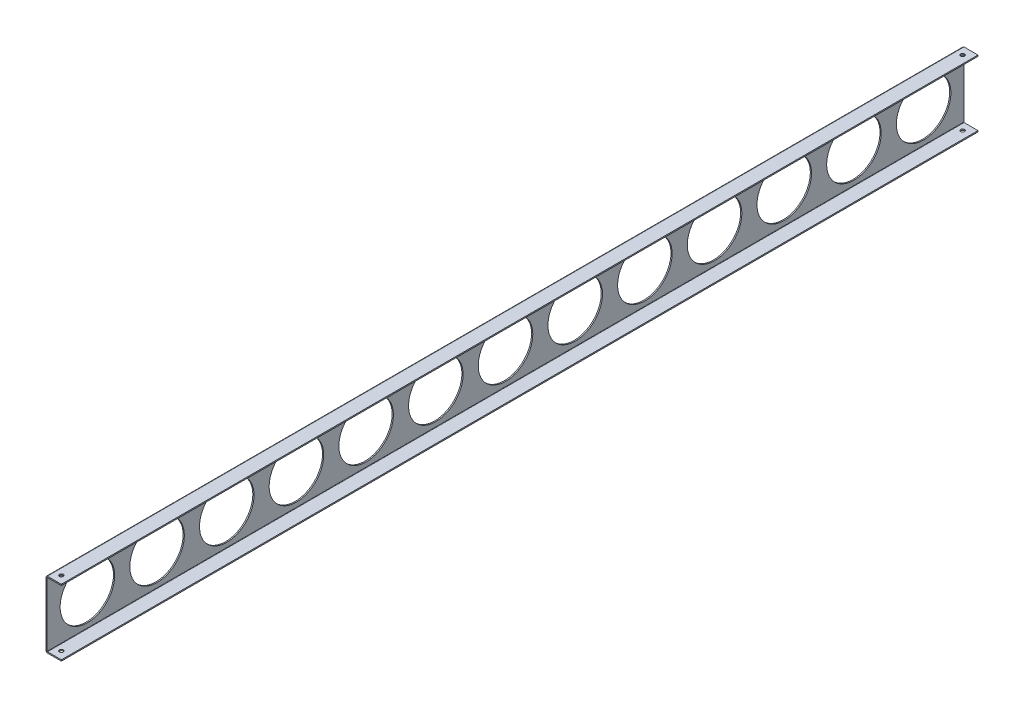
ISO-10303-21;
HEADER;
FILE_DESCRIPTION(('STEP AP214'),'2;1');
FILE_NAME('part.step','',(''),(''),'','','');
FILE_SCHEMA(('AUTOMOTIVE_DESIGN { 1 0 10303 214 1 1 1 1 }'));
ENDSEC;
DATA;
#1=APPLICATION_CONTEXT('core data for automotive mechanical design processes');
#2=APPLICATION_PROTOCOL_DEFINITION('international standard','automotive_design',2000,#1);
#3=PRODUCT_CONTEXT('',#1,'mechanical');
#4=PRODUCT('Part','Part','',(#3));
#5=PRODUCT_RELATED_PRODUCT_CATEGORY('part','',(#4));
#6=PRODUCT_DEFINITION_FORMATION('','',#4);
#7=PRODUCT_DEFINITION_CONTEXT('part definition',#1,'design');
#8=PRODUCT_DEFINITION('design','',#6,#7);
#9=PRODUCT_DEFINITION_SHAPE('','',#8);
#10=(LENGTH_UNIT() NAMED_UNIT(*) SI_UNIT(.MILLI.,.METRE.));
#11=(NAMED_UNIT(*) PLANE_ANGLE_UNIT() SI_UNIT($,.RADIAN.));
#12=(NAMED_UNIT(*) SI_UNIT($,.STERADIAN.) SOLID_ANGLE_UNIT());
#13=UNCERTAINTY_MEASURE_WITH_UNIT(LENGTH_MEASURE(1.E-05),#10,'distance_accuracy_value','');
#14=(GEOMETRIC_REPRESENTATION_CONTEXT(3) GLOBAL_UNCERTAINTY_ASSIGNED_CONTEXT((#13)) GLOBAL_UNIT_ASSIGNED_CONTEXT((#10,
#11,#12)) REPRESENTATION_CONTEXT('',''));
#15=CARTESIAN_POINT('',(0.,0.,0.));
#16=DIRECTION('',(0.,0.,1.));
#17=DIRECTION('',(1.,0.,0.));
#18=AXIS2_PLACEMENT_3D('',#15,#16,#17);
#19=CARTESIAN_POINT('',(2.54000000000002,-55.,756.30962295));
#20=DIRECTION('',(0.,1.,0.));
#21=DIRECTION('',(-1.,0.,0.));
#22=AXIS2_PLACEMENT_3D('',#19,#20,#21);
#23=PLANE('',#22);
#24=DIRECTION('',(1.,0.,0.));
#25=VECTOR('',#24,1.);
#26=CARTESIAN_POINT('',(2.54000000000002,-55.,-756.30962295));
#27=LINE('',#26,#25);
#28=CARTESIAN_POINT('',(2.54000000000002,-55.,-756.30962295));
#29=VERTEX_POINT('',#28);
#30=CARTESIAN_POINT('',(25.4,-55.,-756.30962295));
#31=VERTEX_POINT('',#30);
#32=EDGE_CURVE('E157',#29,#31,#27,.T.);
#33=ORIENTED_EDGE('',*,*,#32,.T.);
#34=DIRECTION('',(0.,0.,-1.));
#35=VECTOR('',#34,1.);
#36=CARTESIAN_POINT('',(25.4,-55.,756.30962295));
#37=LINE('',#36,#35);
#38=CARTESIAN_POINT('',(25.4,-55.,756.30962295));
#39=VERTEX_POINT('',#38);
#40=EDGE_CURVE('E204',#39,#31,#37,.T.);
#41=ORIENTED_EDGE('',*,*,#40,.F.);
#42=DIRECTION('',(1.,0.,0.));
#43=VECTOR('',#42,1.);
#44=CARTESIAN_POINT('',(2.54000000000002,-55.,756.30962295));
#45=LINE('',#44,#43);
#46=CARTESIAN_POINT('',(2.54000000000002,-55.,756.30962295));
#47=VERTEX_POINT('',#46);
#48=EDGE_CURVE('E104',#47,#39,#45,.T.);
#49=ORIENTED_EDGE('',*,*,#48,.F.);
#50=DIRECTION('',(0.,0.,-1.));
#51=VECTOR('',#50,1.);
#52=CARTESIAN_POINT('',(2.54000000000002,-55.,756.30962295));
#53=LINE('',#52,#51);
#54=EDGE_CURVE('E153',#47,#29,#53,.T.);
#55=ORIENTED_EDGE('',*,*,#54,.T.);
#56=EDGE_LOOP('',(#33,#41,#49,#55));
#57=FACE_BOUND('',#56,.T.);
#58=CARTESIAN_POINT('',(12.7,-55.,743.60962295));
#59=DIRECTION('',(0.,-1.,0.));
#60=DIRECTION('',(0.,0.,-1.));
#61=AXIS2_PLACEMENT_3D('',#58,#59,#60);
#62=CIRCLE('',#61,3.175);
#63=CARTESIAN_POINT('',(12.7,-55.,740.43462295));
#64=VERTEX_POINT('',#63);
#65=EDGE_CURVE('E381',#64,#64,#62,.T.);
#66=ORIENTED_EDGE('',*,*,#65,.F.);
#67=EDGE_LOOP('',(#66));
#68=FACE_BOUND('',#67,.T.);
#69=CARTESIAN_POINT('',(12.7,-55.,-743.60962295));
#70=DIRECTION('',(0.,1.,0.));
#71=DIRECTION('',(0.,0.,1.));
#72=AXIS2_PLACEMENT_3D('',#69,#70,#71);
#73=CIRCLE('',#72,3.175);
#74=CARTESIAN_POINT('',(12.7,-55.,-740.43462295));
#75=VERTEX_POINT('',#74);
#76=EDGE_CURVE('E384',#75,#75,#73,.T.);
#77=ORIENTED_EDGE('',*,*,#76,.T.);
#78=EDGE_LOOP('',(#77));
#79=FACE_BOUND('',#78,.T.);
#80=ADVANCED_FACE('F34',(#57,#68,#79),#23,.F.);
#81=CARTESIAN_POINT('',(2.54000000000002,-53.,756.30962295));
#82=DIRECTION('',(0.,1.,0.));
#83=DIRECTION('',(-1.,0.,0.));
#84=AXIS2_PLACEMENT_3D('',#81,#82,#83);
#85=PLANE('',#84);
#86=DIRECTION('',(1.,0.,0.));
#87=VECTOR('',#86,1.);
#88=CARTESIAN_POINT('',(2.54000000000002,-53.,-756.30962295));
#89=LINE('',#88,#87);
#90=CARTESIAN_POINT('',(2.54000000000002,-53.,-756.30962295));
#91=VERTEX_POINT('',#90);
#92=CARTESIAN_POINT('',(25.4,-53.,-756.30962295));
#93=VERTEX_POINT('',#92);
#94=EDGE_CURVE('E164',#91,#93,#89,.T.);
#95=ORIENTED_EDGE('',*,*,#94,.F.);
#96=DIRECTION('',(0.,0.,-1.));
#97=VECTOR('',#96,1.);
#98=CARTESIAN_POINT('',(2.54000000000002,-53.,756.30962295));
#99=LINE('',#98,#97);
#100=CARTESIAN_POINT('',(2.54000000000002,-53.,756.30962295));
#101=VERTEX_POINT('',#100);
#102=EDGE_CURVE('E200',#101,#91,#99,.T.);
#103=ORIENTED_EDGE('',*,*,#102,.F.);
#104=DIRECTION('',(1.,0.,0.));
#105=VECTOR('',#104,1.);
#106=CARTESIAN_POINT('',(2.54000000000002,-53.,756.30962295));
#107=LINE('',#106,#105);
#108=CARTESIAN_POINT('',(25.4,-53.,756.30962295));
#109=VERTEX_POINT('',#108);
#110=EDGE_CURVE('E417',#101,#109,#107,.T.);
#111=ORIENTED_EDGE('',*,*,#110,.T.);
#112=DIRECTION('',(0.,0.,-1.));
#113=VECTOR('',#112,1.);
#114=CARTESIAN_POINT('',(25.4,-53.,756.30962295));
#115=LINE('',#114,#113);
#116=EDGE_CURVE('E202',#109,#93,#115,.T.);
#117=ORIENTED_EDGE('',*,*,#116,.T.);
#118=EDGE_LOOP('',(#95,#103,#111,#117));
#119=FACE_BOUND('',#118,.T.);
#120=CARTESIAN_POINT('',(12.7,-53.,743.60962295));
#121=DIRECTION('',(0.,1.,0.));
#122=DIRECTION('',(-1.,0.,0.));
#123=AXIS2_PLACEMENT_3D('',#120,#121,#122);
#124=CIRCLE('',#123,3.175);
#125=CARTESIAN_POINT('',(9.52499999999998,-53.,743.60962295));
#126=VERTEX_POINT('',#125);
#127=EDGE_CURVE('E394',#126,#126,#124,.T.);
#128=ORIENTED_EDGE('',*,*,#127,.F.);
#129=EDGE_LOOP('',(#128));
#130=FACE_BOUND('',#129,.T.);
#131=CARTESIAN_POINT('',(12.7,-53.,-743.60962295));
#132=DIRECTION('',(0.,1.,0.));
#133=DIRECTION('',(-1.,0.,0.));
#134=AXIS2_PLACEMENT_3D('',#131,#132,#133);
#135=CIRCLE('',#134,3.175);
#136=CARTESIAN_POINT('',(9.52499999999998,-53.,-743.60962295));
#137=VERTEX_POINT('',#136);
#138=EDGE_CURVE('E377',#137,#137,#135,.F.);
#139=ORIENTED_EDGE('',*,*,#138,.T.);
#140=EDGE_LOOP('',(#139));
#141=FACE_BOUND('',#140,.T.);
#142=ADVANCED_FACE('F288',(#119,#130,#141),#85,.T.);
#143=CARTESIAN_POINT('',(2.54000000000002,53.,756.30962295));
#144=DIRECTION('',(0.,-1.,0.));
#145=DIRECTION('',(1.,0.,0.));
#146=AXIS2_PLACEMENT_3D('',#143,#144,#145);
#147=PLANE('',#146);
#148=DIRECTION('',(-1.,0.,0.));
#149=VECTOR('',#148,1.);
#150=CARTESIAN_POINT('',(2.54000000000002,53.,-756.30962295));
#151=LINE('',#150,#149);
#152=CARTESIAN_POINT('',(25.4,53.,-756.30962295));
#153=VERTEX_POINT('',#152);
#154=CARTESIAN_POINT('',(2.54000000000002,53.,-756.30962295));
#155=VERTEX_POINT('',#154);
#156=EDGE_CURVE('E176',#153,#155,#151,.T.);
#157=ORIENTED_EDGE('',*,*,#156,.F.);
#158=DIRECTION('',(0.,0.,-1.));
#159=VECTOR('',#158,1.);
#160=CARTESIAN_POINT('',(25.4,53.,756.30962295));
#161=LINE('',#160,#159);
#162=CARTESIAN_POINT('',(25.4,53.,756.30962295));
#163=VERTEX_POINT('',#162);
#164=EDGE_CURVE('E192',#163,#153,#161,.T.);
#165=ORIENTED_EDGE('',*,*,#164,.F.);
#166=DIRECTION('',(-1.,0.,0.));
#167=VECTOR('',#166,1.);
#168=CARTESIAN_POINT('',(2.54000000000002,53.,756.30962295));
#169=LINE('',#168,#167);
#170=CARTESIAN_POINT('',(2.54000000000002,53.,756.30962295));
#171=VERTEX_POINT('',#170);
#172=EDGE_CURVE('E429',#163,#171,#169,.T.);
#173=ORIENTED_EDGE('',*,*,#172,.T.);
#174=DIRECTION('',(0.,0.,-1.));
#175=VECTOR('',#174,1.);
#176=CARTESIAN_POINT('',(2.54000000000002,53.,756.30962295));
#177=LINE('',#176,#175);
#178=EDGE_CURVE('E194',#171,#155,#177,.T.);
#179=ORIENTED_EDGE('',*,*,#178,.T.);
#180=EDGE_LOOP('',(#157,#165,#173,#179));
#181=FACE_BOUND('',#180,.T.);
#182=CARTESIAN_POINT('',(12.7,53.,743.60962295));
#183=DIRECTION('',(0.,-1.,0.));
#184=DIRECTION('',(1.,0.,0.));
#185=AXIS2_PLACEMENT_3D('',#182,#183,#184);
#186=CIRCLE('',#185,3.175);
#187=CARTESIAN_POINT('',(15.875,53.,743.60962295));
#188=VERTEX_POINT('',#187);
#189=EDGE_CURVE('E372',#188,#188,#186,.T.);
#190=ORIENTED_EDGE('',*,*,#189,.F.);
#191=EDGE_LOOP('',(#190));
#192=FACE_BOUND('',#191,.T.);
#193=CARTESIAN_POINT('',(12.7,53.,-743.60962295));
#194=DIRECTION('',(0.,-1.,0.));
#195=DIRECTION('',(1.,0.,0.));
#196=AXIS2_PLACEMENT_3D('',#193,#194,#195);
#197=CIRCLE('',#196,3.175);
#198=CARTESIAN_POINT('',(15.875,53.,-743.60962295));
#199=VERTEX_POINT('',#198);
#200=EDGE_CURVE('E375',#199,#199,#197,.F.);
#201=ORIENTED_EDGE('',*,*,#200,.T.);
#202=EDGE_LOOP('',(#201));
#203=FACE_BOUND('',#202,.T.);
#204=ADVANCED_FACE('F294',(#181,#192,#203),#147,.T.);
#205=CARTESIAN_POINT('',(2.54000000000002,55.,756.30962295));
#206=DIRECTION('',(0.,-1.,0.));
#207=DIRECTION('',(1.,0.,0.));
#208=AXIS2_PLACEMENT_3D('',#205,#206,#207);
#209=PLANE('',#208);
#210=DIRECTION('',(-1.,0.,0.));
#211=VECTOR('',#210,1.);
#212=CARTESIAN_POINT('',(2.54000000000002,55.,-756.30962295));
#213=LINE('',#212,#211);
#214=CARTESIAN_POINT('',(25.4,55.,-756.30962295));
#215=VERTEX_POINT('',#214);
#216=CARTESIAN_POINT('',(2.54000000000002,55.,-756.30962295));
#217=VERTEX_POINT('',#216);
#218=EDGE_CURVE('E182',#215,#217,#213,.T.);
#219=ORIENTED_EDGE('',*,*,#218,.T.);
#220=DIRECTION('',(0.,0.,-1.));
#221=VECTOR('',#220,1.);
#222=CARTESIAN_POINT('',(2.54000000000002,55.,756.30962295));
#223=LINE('',#222,#221);
#224=CARTESIAN_POINT('',(2.54000000000002,55.,756.30962295));
#225=VERTEX_POINT('',#224);
#226=EDGE_CURVE('E147',#225,#217,#223,.T.);
#227=ORIENTED_EDGE('',*,*,#226,.F.);
#228=DIRECTION('',(-1.,0.,0.));
#229=VECTOR('',#228,1.);
#230=CARTESIAN_POINT('',(2.54000000000002,55.,756.30962295));
#231=LINE('',#230,#229);
#232=CARTESIAN_POINT('',(25.4,55.,756.30962295));
#233=VERTEX_POINT('',#232);
#234=EDGE_CURVE('E138',#233,#225,#231,.T.);
#235=ORIENTED_EDGE('',*,*,#234,.F.);
#236=DIRECTION('',(0.,0.,-1.));
#237=VECTOR('',#236,1.);
#238=CARTESIAN_POINT('',(25.4,55.,756.30962295));
#239=LINE('',#238,#237);
#240=EDGE_CURVE('E190',#233,#215,#239,.T.);
#241=ORIENTED_EDGE('',*,*,#240,.T.);
#242=EDGE_LOOP('',(#219,#227,#235,#241));
#243=FACE_BOUND('',#242,.T.);
#244=CARTESIAN_POINT('',(12.7,55.,743.60962295));
#245=DIRECTION('',(0.,-1.,0.));
#246=DIRECTION('',(0.,0.,-1.));
#247=AXIS2_PLACEMENT_3D('',#244,#245,#246);
#248=CIRCLE('',#247,3.175);
#249=CARTESIAN_POINT('',(12.7,55.,740.43462295));
#250=VERTEX_POINT('',#249);
#251=EDGE_CURVE('E388',#250,#250,#248,.T.);
#252=ORIENTED_EDGE('',*,*,#251,.T.);
#253=EDGE_LOOP('',(#252));
#254=FACE_BOUND('',#253,.T.);
#255=CARTESIAN_POINT('',(12.7,55.,-743.60962295));
#256=DIRECTION('',(0.,1.,0.));
#257=DIRECTION('',(0.,0.,1.));
#258=AXIS2_PLACEMENT_3D('',#255,#256,#257);
#259=CIRCLE('',#258,3.175);
#260=CARTESIAN_POINT('',(12.7,55.,-740.43462295));
#261=VERTEX_POINT('',#260);
#262=EDGE_CURVE('E378',#261,#261,#259,.T.);
#263=ORIENTED_EDGE('',*,*,#262,.F.);
#264=EDGE_LOOP('',(#263));
#265=FACE_BOUND('',#264,.T.);
#266=ADVANCED_FACE('F356',(#243,#254,#265),#209,.F.);
#267=CARTESIAN_POINT('',(25.4,-53.,756.30962295));
#268=DIRECTION('',(1.,0.,0.));
#269=DIRECTION('',(0.,1.,0.));
#270=AXIS2_PLACEMENT_3D('',#267,#268,#269);
#271=PLANE('',#270);
#272=DIRECTION('',(0.,-1.,0.));
#273=VECTOR('',#272,1.);
#274=CARTESIAN_POINT('',(25.4,-53.,-756.30962295));
#275=LINE('',#274,#273);
#276=EDGE_CURVE('E160',#93,#31,#275,.T.);
#277=ORIENTED_EDGE('',*,*,#276,.F.);
#278=ORIENTED_EDGE('',*,*,#116,.F.);
#279=DIRECTION('',(0.,-1.,0.));
#280=VECTOR('',#279,1.);
#281=CARTESIAN_POINT('',(25.4,-53.,756.30962295));
#282=LINE('',#281,#280);
#283=EDGE_CURVE('E414',#109,#39,#282,.T.);
#284=ORIENTED_EDGE('',*,*,#283,.T.);
#285=ORIENTED_EDGE('',*,*,#40,.T.);
#286=EDGE_LOOP('',(#277,#278,#284,#285));
#287=FACE_BOUND('',#286,.T.);
#288=ADVANCED_FACE('F282',(#287),#271,.T.);
#289=CARTESIAN_POINT('',(2.54000000000002,-52.46,756.30962295));
#290=DIRECTION('',(0.,0.,-1.));
#291=DIRECTION('',(-1.,0.,0.));
#292=AXIS2_PLACEMENT_3D('',#289,#290,#291);
#293=CYLINDRICAL_SURFACE('',#292,0.540000000000001);
#294=CARTESIAN_POINT('',(2.54000000000002,-52.46,-756.30962295));
#295=DIRECTION('',(0.,0.,1.));
#296=DIRECTION('',(1.,0.,0.));
#297=AXIS2_PLACEMENT_3D('',#294,#295,#296);
#298=CIRCLE('',#297,0.540000000000001);
#299=CARTESIAN_POINT('',(2.00000000000002,-52.46,-756.30962295));
#300=VERTEX_POINT('',#299);
#301=EDGE_CURVE('E167',#300,#91,#298,.T.);
#302=ORIENTED_EDGE('',*,*,#301,.F.);
#303=DIRECTION('',(0.,0.,-1.));
#304=VECTOR('',#303,1.);
#305=CARTESIAN_POINT('',(2.00000000000002,-52.46,756.30962295));
#306=LINE('',#305,#304);
#307=CARTESIAN_POINT('',(2.00000000000002,-52.46,756.30962295));
#308=VERTEX_POINT('',#307);
#309=EDGE_CURVE('E198',#308,#300,#306,.T.);
#310=ORIENTED_EDGE('',*,*,#309,.F.);
#311=CARTESIAN_POINT('',(2.54000000000002,-52.46,756.30962295));
#312=DIRECTION('',(0.,0.,1.));
#313=DIRECTION('',(1.,0.,0.));
#314=AXIS2_PLACEMENT_3D('',#311,#312,#313);
#315=CIRCLE('',#314,0.540000000000001);
#316=EDGE_CURVE('E420',#308,#101,#315,.T.);
#317=ORIENTED_EDGE('',*,*,#316,.T.);
#318=ORIENTED_EDGE('',*,*,#102,.T.);
#319=EDGE_LOOP('',(#302,#310,#317,#318));
#320=FACE_BOUND('',#319,.T.);
#321=ADVANCED_FACE('F272',(#320),#293,.F.);
#322=CARTESIAN_POINT('',(2.00000000000002,52.46,756.30962295));
#323=DIRECTION('',(1.,0.,0.));
#324=DIRECTION('',(0.,0.,-1.));
#325=AXIS2_PLACEMENT_3D('',#322,#323,#324);
#326=PLANE('',#325);
#327=CARTESIAN_POINT('',(2.00000000000002,0.,-115.));
#328=DIRECTION('',(1.,0.,0.));
#329=DIRECTION('',(0.,0.,-1.));
#330=AXIS2_PLACEMENT_3D('',#327,#328,#329);
#331=CIRCLE('',#330,45.);
#332=CARTESIAN_POINT('',(2.00000000000002,0.,-160.));
#333=VERTEX_POINT('',#332);
#334=EDGE_CURVE('E399',#333,#333,#331,.T.);
#335=ORIENTED_EDGE('',*,*,#334,.F.);
#336=EDGE_LOOP('',(#335));
#337=FACE_BOUND('',#336,.T.);
#338=CARTESIAN_POINT('',(2.00000000000002,0.,115.));
#339=DIRECTION('',(1.,0.,0.));
#340=DIRECTION('',(0.,0.,-1.));
#341=AXIS2_PLACEMENT_3D('',#338,#339,#340);
#342=CIRCLE('',#341,45.);
#343=CARTESIAN_POINT('',(2.00000000000002,0.,70.));
#344=VERTEX_POINT('',#343);
#345=EDGE_CURVE('E405',#344,#344,#342,.T.);
#346=ORIENTED_EDGE('',*,*,#345,.F.);
#347=EDGE_LOOP('',(#346));
#348=FACE_BOUND('',#347,.T.);
#349=CARTESIAN_POINT('',(2.00000000000002,0.,0.));
#350=DIRECTION('',(1.,0.,0.));
#351=DIRECTION('',(0.,0.,-1.));
#352=AXIS2_PLACEMENT_3D('',#349,#350,#351);
#353=CIRCLE('',#352,45.);
#354=CARTESIAN_POINT('',(2.00000000000002,0.,-45.));
#355=VERTEX_POINT('',#354);
#356=EDGE_CURVE('E408',#355,#355,#353,.T.);
#357=ORIENTED_EDGE('',*,*,#356,.F.);
#358=EDGE_LOOP('',(#357));
#359=FACE_BOUND('',#358,.T.);
#360=DIRECTION('',(0.,1.,0.));
#361=VECTOR('',#360,1.);
#362=CARTESIAN_POINT('',(2.00000000000002,52.46,-756.30962295));
#363=LINE('',#362,#361);
#364=CARTESIAN_POINT('',(2.00000000000002,52.46,-756.30962295));
#365=VERTEX_POINT('',#364);
#366=EDGE_CURVE('E170',#365,#300,#363,.F.);
#367=ORIENTED_EDGE('',*,*,#366,.F.);
#368=DIRECTION('',(0.,0.,-1.));
#369=VECTOR('',#368,1.);
#370=CARTESIAN_POINT('',(2.00000000000002,52.46,756.30962295));
#371=LINE('',#370,#369);
#372=CARTESIAN_POINT('',(2.00000000000002,52.46,756.30962295));
#373=VERTEX_POINT('',#372);
#374=EDGE_CURVE('E196',#373,#365,#371,.T.);
#375=ORIENTED_EDGE('',*,*,#374,.F.);
#376=DIRECTION('',(0.,1.,0.));
#377=VECTOR('',#376,1.);
#378=CARTESIAN_POINT('',(2.00000000000002,52.46,756.30962295));
#379=LINE('',#378,#377);
#380=EDGE_CURVE('E423',#373,#308,#379,.F.);
#381=ORIENTED_EDGE('',*,*,#380,.T.);
#382=ORIENTED_EDGE('',*,*,#309,.T.);
#383=EDGE_LOOP('',(#367,#375,#381,#382));
#384=FACE_BOUND('',#383,.T.);
#385=CARTESIAN_POINT('',(2.00000000000002,0.,230.));
#386=DIRECTION('',(1.,0.,0.));
#387=DIRECTION('',(0.,0.,-1.));
#388=AXIS2_PLACEMENT_3D('',#385,#386,#387);
#389=CIRCLE('',#388,45.);
#390=CARTESIAN_POINT('',(2.00000000000002,0.,185.));
#391=VERTEX_POINT('',#390);
#392=EDGE_CURVE('E209',#391,#391,#389,.T.);
#393=ORIENTED_EDGE('',*,*,#392,.F.);
#394=EDGE_LOOP('',(#393));
#395=FACE_BOUND('',#394,.T.);
#396=CARTESIAN_POINT('',(2.00000000000002,0.,345.));
#397=DIRECTION('',(1.,0.,0.));
#398=DIRECTION('',(0.,0.,-1.));
#399=AXIS2_PLACEMENT_3D('',#396,#397,#398);
#400=CIRCLE('',#399,45.);
#401=CARTESIAN_POINT('',(2.00000000000002,0.,300.));
#402=VERTEX_POINT('',#401);
#403=EDGE_CURVE('E215',#402,#402,#400,.T.);
#404=ORIENTED_EDGE('',*,*,#403,.F.);
#405=EDGE_LOOP('',(#404));
#406=FACE_BOUND('',#405,.T.);
#407=CARTESIAN_POINT('',(2.00000000000002,0.,460.));
#408=DIRECTION('',(1.,0.,0.));
#409=DIRECTION('',(0.,0.,-1.));
#410=AXIS2_PLACEMENT_3D('',#407,#408,#409);
#411=CIRCLE('',#410,45.);
#412=CARTESIAN_POINT('',(2.00000000000002,0.,415.));
#413=VERTEX_POINT('',#412);
#414=EDGE_CURVE('E221',#413,#413,#411,.T.);
#415=ORIENTED_EDGE('',*,*,#414,.F.);
#416=EDGE_LOOP('',(#415));
#417=FACE_BOUND('',#416,.T.);
#418=CARTESIAN_POINT('',(2.00000000000002,0.,575.));
#419=DIRECTION('',(1.,0.,0.));
#420=DIRECTION('',(0.,0.,-1.));
#421=AXIS2_PLACEMENT_3D('',#418,#419,#420);
#422=CIRCLE('',#421,45.);
#423=CARTESIAN_POINT('',(2.00000000000002,0.,530.));
#424=VERTEX_POINT('',#423);
#425=EDGE_CURVE('E227',#424,#424,#422,.T.);
#426=ORIENTED_EDGE('',*,*,#425,.F.);
#427=EDGE_LOOP('',(#426));
#428=FACE_BOUND('',#427,.T.);
#429=CARTESIAN_POINT('',(2.00000000000002,0.,690.));
#430=DIRECTION('',(1.,0.,0.));
#431=DIRECTION('',(0.,0.,-1.));
#432=AXIS2_PLACEMENT_3D('',#429,#430,#431);
#433=CIRCLE('',#432,45.);
#434=CARTESIAN_POINT('',(2.00000000000002,0.,645.));
#435=VERTEX_POINT('',#434);
#436=EDGE_CURVE('E233',#435,#435,#433,.T.);
#437=ORIENTED_EDGE('',*,*,#436,.F.);
#438=EDGE_LOOP('',(#437));
#439=FACE_BOUND('',#438,.T.);
#440=CARTESIAN_POINT('',(2.00000000000002,0.,-230.));
#441=DIRECTION('',(1.,0.,0.));
#442=DIRECTION('',(0.,0.,-1.));
#443=AXIS2_PLACEMENT_3D('',#440,#441,#442);
#444=CIRCLE('',#443,45.);
#445=CARTESIAN_POINT('',(2.00000000000002,0.,-275.));
#446=VERTEX_POINT('',#445);
#447=EDGE_CURVE('E239',#446,#446,#444,.T.);
#448=ORIENTED_EDGE('',*,*,#447,.F.);
#449=EDGE_LOOP('',(#448));
#450=FACE_BOUND('',#449,.T.);
#451=CARTESIAN_POINT('',(2.00000000000002,0.,-345.));
#452=DIRECTION('',(1.,0.,0.));
#453=DIRECTION('',(0.,0.,-1.));
#454=AXIS2_PLACEMENT_3D('',#451,#452,#453);
#455=CIRCLE('',#454,45.);
#456=CARTESIAN_POINT('',(2.00000000000002,0.,-390.));
#457=VERTEX_POINT('',#456);
#458=EDGE_CURVE('E245',#457,#457,#455,.T.);
#459=ORIENTED_EDGE('',*,*,#458,.F.);
#460=EDGE_LOOP('',(#459));
#461=FACE_BOUND('',#460,.T.);
#462=CARTESIAN_POINT('',(2.00000000000002,0.,-460.));
#463=DIRECTION('',(1.,0.,0.));
#464=DIRECTION('',(0.,0.,-1.));
#465=AXIS2_PLACEMENT_3D('',#462,#463,#464);
#466=CIRCLE('',#465,45.);
#467=CARTESIAN_POINT('',(2.00000000000002,0.,-505.));
#468=VERTEX_POINT('',#467);
#469=EDGE_CURVE('E251',#468,#468,#466,.T.);
#470=ORIENTED_EDGE('',*,*,#469,.F.);
#471=EDGE_LOOP('',(#470));
#472=FACE_BOUND('',#471,.T.);
#473=CARTESIAN_POINT('',(2.00000000000002,0.,-575.));
#474=DIRECTION('',(1.,0.,0.));
#475=DIRECTION('',(0.,0.,-1.));
#476=AXIS2_PLACEMENT_3D('',#473,#474,#475);
#477=CIRCLE('',#476,45.);
#478=CARTESIAN_POINT('',(2.00000000000002,0.,-620.));
#479=VERTEX_POINT('',#478);
#480=EDGE_CURVE('E257',#479,#479,#477,.T.);
#481=ORIENTED_EDGE('',*,*,#480,.F.);
#482=EDGE_LOOP('',(#481));
#483=FACE_BOUND('',#482,.T.);
#484=CARTESIAN_POINT('',(2.00000000000002,0.,-690.));
#485=DIRECTION('',(1.,0.,0.));
#486=DIRECTION('',(0.,0.,-1.));
#487=AXIS2_PLACEMENT_3D('',#484,#485,#486);
#488=CIRCLE('',#487,45.);
#489=CARTESIAN_POINT('',(2.00000000000002,0.,-735.));
#490=VERTEX_POINT('',#489);
#491=EDGE_CURVE('E11',#490,#490,#488,.T.);
#492=ORIENTED_EDGE('',*,*,#491,.F.);
#493=EDGE_LOOP('',(#492));
#494=FACE_BOUND('',#493,.T.);
#495=ADVANCED_FACE('F269',(#337,#348,#359,#384,#395,#406,#417,#428,#439,#450,#461,#472,#483,
#494),#326,.T.);
#496=CARTESIAN_POINT('',(2.54000000000002,52.46,756.30962295));
#497=DIRECTION('',(0.,0.,-1.));
#498=DIRECTION('',(-1.,0.,0.));
#499=AXIS2_PLACEMENT_3D('',#496,#497,#498);
#500=CYLINDRICAL_SURFACE('',#499,0.540000000000001);
#501=CARTESIAN_POINT('',(2.54000000000002,52.46,-756.30962295));
#502=DIRECTION('',(0.,0.,1.));
#503=DIRECTION('',(1.,0.,0.));
#504=AXIS2_PLACEMENT_3D('',#501,#502,#503);
#505=CIRCLE('',#504,0.540000000000001);
#506=EDGE_CURVE('E173',#155,#365,#505,.T.);
#507=ORIENTED_EDGE('',*,*,#506,.F.);
#508=ORIENTED_EDGE('',*,*,#178,.F.);
#509=CARTESIAN_POINT('',(2.54000000000002,52.46,756.30962295));
#510=DIRECTION('',(0.,0.,1.));
#511=DIRECTION('',(1.,0.,0.));
#512=AXIS2_PLACEMENT_3D('',#509,#510,#511);
#513=CIRCLE('',#512,0.540000000000001);
#514=EDGE_CURVE('E426',#171,#373,#513,.T.);
#515=ORIENTED_EDGE('',*,*,#514,.T.);
#516=ORIENTED_EDGE('',*,*,#374,.T.);
#517=EDGE_LOOP('',(#507,#508,#515,#516));
#518=FACE_BOUND('',#517,.T.);
#519=ADVANCED_FACE('F271',(#518),#500,.F.);
#520=CARTESIAN_POINT('',(25.4,55.,756.30962295));
#521=DIRECTION('',(1.,0.,0.));
#522=DIRECTION('',(0.,1.,0.));
#523=AXIS2_PLACEMENT_3D('',#520,#521,#522);
#524=PLANE('',#523);
#525=DIRECTION('',(0.,-1.,0.));
#526=VECTOR('',#525,1.);
#527=CARTESIAN_POINT('',(25.4,55.,-756.30962295));
#528=LINE('',#527,#526);
#529=EDGE_CURVE('E179',#215,#153,#528,.T.);
#530=ORIENTED_EDGE('',*,*,#529,.F.);
#531=ORIENTED_EDGE('',*,*,#240,.F.);
#532=DIRECTION('',(0.,-1.,0.));
#533=VECTOR('',#532,1.);
#534=CARTESIAN_POINT('',(25.4,55.,756.30962295));
#535=LINE('',#534,#533);
#536=EDGE_CURVE('E432',#233,#163,#535,.T.);
#537=ORIENTED_EDGE('',*,*,#536,.T.);
#538=ORIENTED_EDGE('',*,*,#164,.T.);
#539=EDGE_LOOP('',(#530,#531,#537,#538));
#540=FACE_BOUND('',#539,.T.);
#541=ADVANCED_FACE('F279',(#540),#524,.T.);
#542=CARTESIAN_POINT('',(2.54000000000002,52.46,756.30962295));
#543=DIRECTION('',(0.,0.,-1.));
#544=DIRECTION('',(-1.,0.,0.));
#545=AXIS2_PLACEMENT_3D('',#542,#543,#544);
#546=CYLINDRICAL_SURFACE('',#545,2.54);
#547=CARTESIAN_POINT('',(2.54000000000002,52.46,-756.30962295));
#548=DIRECTION('',(0.,0.,1.));
#549=DIRECTION('',(-1.,0.,0.));
#550=AXIS2_PLACEMENT_3D('',#547,#548,#549);
#551=CIRCLE('',#550,2.54);
#552=CARTESIAN_POINT('',(0.,52.46,-756.30962295));
#553=VERTEX_POINT('',#552);
#554=EDGE_CURVE('E146',#217,#553,#551,.T.);
#555=ORIENTED_EDGE('',*,*,#554,.T.);
#556=DIRECTION('',(0.,0.,-1.));
#557=VECTOR('',#556,1.);
#558=CARTESIAN_POINT('',(0.,52.46,756.30962295));
#559=LINE('',#558,#557);
#560=CARTESIAN_POINT('',(0.,52.46,756.30962295));
#561=VERTEX_POINT('',#560);
#562=EDGE_CURVE('E143',#561,#553,#559,.T.);
#563=ORIENTED_EDGE('',*,*,#562,.F.);
#564=CARTESIAN_POINT('',(2.54000000000002,52.46,756.30962295));
#565=DIRECTION('',(0.,0.,1.));
#566=DIRECTION('',(-1.,0.,0.));
#567=AXIS2_PLACEMENT_3D('',#564,#565,#566);
#568=CIRCLE('',#567,2.54);
#569=EDGE_CURVE('E131',#225,#561,#568,.T.);
#570=ORIENTED_EDGE('',*,*,#569,.F.);
#571=ORIENTED_EDGE('',*,*,#226,.T.);
#572=EDGE_LOOP('',(#555,#563,#570,#571));
#573=FACE_BOUND('',#572,.T.);
#574=ADVANCED_FACE('F144',(#573),#546,.T.);
#575=CARTESIAN_POINT('',(0.,52.46,756.30962295));
#576=DIRECTION('',(1.,0.,0.));
#577=DIRECTION('',(0.,0.,-1.));
#578=AXIS2_PLACEMENT_3D('',#575,#576,#577);
#579=PLANE('',#578);
#580=CARTESIAN_POINT('',(0.,0.,-115.));
#581=DIRECTION('',(1.,0.,0.));
#582=DIRECTION('',(0.,0.,-1.));
#583=AXIS2_PLACEMENT_3D('',#580,#581,#582);
#584=CIRCLE('',#583,45.);
#585=CARTESIAN_POINT('',(0.,0.,-160.));
#586=VERTEX_POINT('',#585);
#587=EDGE_CURVE('E397',#586,#586,#584,.T.);
#588=ORIENTED_EDGE('',*,*,#587,.T.);
#589=EDGE_LOOP('',(#588));
#590=FACE_BOUND('',#589,.T.);
#591=CARTESIAN_POINT('',(0.,0.,115.));
#592=DIRECTION('',(1.,0.,0.));
#593=DIRECTION('',(0.,0.,-1.));
#594=AXIS2_PLACEMENT_3D('',#591,#592,#593);
#595=CIRCLE('',#594,45.);
#596=CARTESIAN_POINT('',(0.,0.,70.));
#597=VERTEX_POINT('',#596);
#598=EDGE_CURVE('E402',#597,#597,#595,.T.);
#599=ORIENTED_EDGE('',*,*,#598,.T.);
#600=EDGE_LOOP('',(#599));
#601=FACE_BOUND('',#600,.T.);
#602=CARTESIAN_POINT('',(0.,0.,0.));
#603=DIRECTION('',(1.,0.,0.));
#604=DIRECTION('',(0.,0.,-1.));
#605=AXIS2_PLACEMENT_3D('',#602,#603,#604);
#606=CIRCLE('',#605,45.);
#607=CARTESIAN_POINT('',(0.,0.,-45.));
#608=VERTEX_POINT('',#607);
#609=EDGE_CURVE('E161',#608,#608,#606,.T.);
#610=ORIENTED_EDGE('',*,*,#609,.T.);
#611=EDGE_LOOP('',(#610));
#612=FACE_BOUND('',#611,.T.);
#613=DIRECTION('',(0.,-1.,0.));
#614=VECTOR('',#613,1.);
#615=CARTESIAN_POINT('',(0.,52.46,-756.30962295));
#616=LINE('',#615,#614);
#617=CARTESIAN_POINT('',(0.,-52.46,-756.30962295));
#618=VERTEX_POINT('',#617);
#619=EDGE_CURVE('E92',#553,#618,#616,.T.);
#620=ORIENTED_EDGE('',*,*,#619,.T.);
#621=DIRECTION('',(0.,0.,-1.));
#622=VECTOR('',#621,1.);
#623=CARTESIAN_POINT('',(0.,-52.46,756.30962295));
#624=LINE('',#623,#622);
#625=CARTESIAN_POINT('',(0.,-52.46,756.30962295));
#626=VERTEX_POINT('',#625);
#627=EDGE_CURVE('E148',#626,#618,#624,.T.);
#628=ORIENTED_EDGE('',*,*,#627,.F.);
#629=DIRECTION('',(0.,-1.,0.));
#630=VECTOR('',#629,1.);
#631=CARTESIAN_POINT('',(0.,52.46,756.30962295));
#632=LINE('',#631,#630);
#633=EDGE_CURVE('E135',#561,#626,#632,.T.);
#634=ORIENTED_EDGE('',*,*,#633,.F.);
#635=ORIENTED_EDGE('',*,*,#562,.T.);
#636=EDGE_LOOP('',(#620,#628,#634,#635));
#637=FACE_BOUND('',#636,.T.);
#638=CARTESIAN_POINT('',(0.,0.,230.));
#639=DIRECTION('',(1.,0.,0.));
#640=DIRECTION('',(0.,0.,-1.));
#641=AXIS2_PLACEMENT_3D('',#638,#639,#640);
#642=CIRCLE('',#641,45.);
#643=CARTESIAN_POINT('',(0.,0.,185.));
#644=VERTEX_POINT('',#643);
#645=EDGE_CURVE('E206',#644,#644,#642,.T.);
#646=ORIENTED_EDGE('',*,*,#645,.T.);
#647=EDGE_LOOP('',(#646));
#648=FACE_BOUND('',#647,.T.);
#649=CARTESIAN_POINT('',(0.,0.,345.));
#650=DIRECTION('',(1.,0.,0.));
#651=DIRECTION('',(0.,0.,-1.));
#652=AXIS2_PLACEMENT_3D('',#649,#650,#651);
#653=CIRCLE('',#652,45.);
#654=CARTESIAN_POINT('',(0.,0.,300.));
#655=VERTEX_POINT('',#654);
#656=EDGE_CURVE('E212',#655,#655,#653,.T.);
#657=ORIENTED_EDGE('',*,*,#656,.T.);
#658=EDGE_LOOP('',(#657));
#659=FACE_BOUND('',#658,.T.);
#660=CARTESIAN_POINT('',(0.,0.,460.));
#661=DIRECTION('',(1.,0.,0.));
#662=DIRECTION('',(0.,0.,-1.));
#663=AXIS2_PLACEMENT_3D('',#660,#661,#662);
#664=CIRCLE('',#663,45.);
#665=CARTESIAN_POINT('',(0.,0.,415.));
#666=VERTEX_POINT('',#665);
#667=EDGE_CURVE('E218',#666,#666,#664,.T.);
#668=ORIENTED_EDGE('',*,*,#667,.T.);
#669=EDGE_LOOP('',(#668));
#670=FACE_BOUND('',#669,.T.);
#671=CARTESIAN_POINT('',(0.,0.,575.));
#672=DIRECTION('',(1.,0.,0.));
#673=DIRECTION('',(0.,0.,-1.));
#674=AXIS2_PLACEMENT_3D('',#671,#672,#673);
#675=CIRCLE('',#674,45.);
#676=CARTESIAN_POINT('',(0.,0.,530.));
#677=VERTEX_POINT('',#676);
#678=EDGE_CURVE('E224',#677,#677,#675,.T.);
#679=ORIENTED_EDGE('',*,*,#678,.T.);
#680=EDGE_LOOP('',(#679));
#681=FACE_BOUND('',#680,.T.);
#682=CARTESIAN_POINT('',(0.,0.,690.));
#683=DIRECTION('',(1.,0.,0.));
#684=DIRECTION('',(0.,0.,-1.));
#685=AXIS2_PLACEMENT_3D('',#682,#683,#684);
#686=CIRCLE('',#685,45.);
#687=CARTESIAN_POINT('',(0.,0.,645.));
#688=VERTEX_POINT('',#687);
#689=EDGE_CURVE('E230',#688,#688,#686,.T.);
#690=ORIENTED_EDGE('',*,*,#689,.T.);
#691=EDGE_LOOP('',(#690));
#692=FACE_BOUND('',#691,.T.);
#693=CARTESIAN_POINT('',(0.,0.,-230.));
#694=DIRECTION('',(1.,0.,0.));
#695=DIRECTION('',(0.,0.,-1.));
#696=AXIS2_PLACEMENT_3D('',#693,#694,#695);
#697=CIRCLE('',#696,45.);
#698=CARTESIAN_POINT('',(0.,0.,-275.));
#699=VERTEX_POINT('',#698);
#700=EDGE_CURVE('E236',#699,#699,#697,.T.);
#701=ORIENTED_EDGE('',*,*,#700,.T.);
#702=EDGE_LOOP('',(#701));
#703=FACE_BOUND('',#702,.T.);
#704=CARTESIAN_POINT('',(0.,0.,-345.));
#705=DIRECTION('',(1.,0.,0.));
#706=DIRECTION('',(0.,0.,-1.));
#707=AXIS2_PLACEMENT_3D('',#704,#705,#706);
#708=CIRCLE('',#707,45.);
#709=CARTESIAN_POINT('',(0.,0.,-390.));
#710=VERTEX_POINT('',#709);
#711=EDGE_CURVE('E242',#710,#710,#708,.T.);
#712=ORIENTED_EDGE('',*,*,#711,.T.);
#713=EDGE_LOOP('',(#712));
#714=FACE_BOUND('',#713,.T.);
#715=CARTESIAN_POINT('',(0.,0.,-460.));
#716=DIRECTION('',(1.,0.,0.));
#717=DIRECTION('',(0.,0.,-1.));
#718=AXIS2_PLACEMENT_3D('',#715,#716,#717);
#719=CIRCLE('',#718,45.);
#720=CARTESIAN_POINT('',(0.,0.,-505.));
#721=VERTEX_POINT('',#720);
#722=EDGE_CURVE('E248',#721,#721,#719,.T.);
#723=ORIENTED_EDGE('',*,*,#722,.T.);
#724=EDGE_LOOP('',(#723));
#725=FACE_BOUND('',#724,.T.);
#726=CARTESIAN_POINT('',(0.,0.,-575.));
#727=DIRECTION('',(1.,0.,0.));
#728=DIRECTION('',(0.,0.,-1.));
#729=AXIS2_PLACEMENT_3D('',#726,#727,#728);
#730=CIRCLE('',#729,45.);
#731=CARTESIAN_POINT('',(0.,0.,-620.));
#732=VERTEX_POINT('',#731);
#733=EDGE_CURVE('E254',#732,#732,#730,.T.);
#734=ORIENTED_EDGE('',*,*,#733,.T.);
#735=EDGE_LOOP('',(#734));
#736=FACE_BOUND('',#735,.T.);
#737=CARTESIAN_POINT('',(0.,0.,-690.));
#738=DIRECTION('',(1.,0.,0.));
#739=DIRECTION('',(0.,0.,-1.));
#740=AXIS2_PLACEMENT_3D('',#737,#738,#739);
#741=CIRCLE('',#740,45.);
#742=CARTESIAN_POINT('',(0.,0.,-735.));
#743=VERTEX_POINT('',#742);
#744=EDGE_CURVE('E43',#743,#743,#741,.T.);
#745=ORIENTED_EDGE('',*,*,#744,.T.);
#746=EDGE_LOOP('',(#745));
#747=FACE_BOUND('',#746,.T.);
#748=ADVANCED_FACE('F150',(#590,#601,#612,#637,#648,#659,#670,#681,#692,#703,#714,#725,#736,
#747),#579,.F.);
#749=CARTESIAN_POINT('',(2.54000000000002,-52.46,756.30962295));
#750=DIRECTION('',(0.,0.,-1.));
#751=DIRECTION('',(-1.,0.,0.));
#752=AXIS2_PLACEMENT_3D('',#749,#750,#751);
#753=CYLINDRICAL_SURFACE('',#752,2.54);
#754=CARTESIAN_POINT('',(2.54000000000002,-52.46,-756.30962295));
#755=DIRECTION('',(0.,0.,1.));
#756=DIRECTION('',(1.,0.,0.));
#757=AXIS2_PLACEMENT_3D('',#754,#755,#756);
#758=CIRCLE('',#757,2.54);
#759=EDGE_CURVE('E98',#618,#29,#758,.T.);
#760=ORIENTED_EDGE('',*,*,#759,.T.);
#761=ORIENTED_EDGE('',*,*,#54,.F.);
#762=CARTESIAN_POINT('',(2.54000000000002,-52.46,756.30962295));
#763=DIRECTION('',(0.,0.,1.));
#764=DIRECTION('',(1.,0.,0.));
#765=AXIS2_PLACEMENT_3D('',#762,#763,#764);
#766=CIRCLE('',#765,2.54);
#767=EDGE_CURVE('E51',#626,#47,#766,.T.);
#768=ORIENTED_EDGE('',*,*,#767,.F.);
#769=ORIENTED_EDGE('',*,*,#627,.T.);
#770=EDGE_LOOP('',(#760,#761,#768,#769));
#771=FACE_BOUND('',#770,.T.);
#772=ADVANCED_FACE('F343',(#771),#753,.T.);
#773=CARTESIAN_POINT('',(2.54000000000002,-52.46,756.30962295));
#774=DIRECTION('',(0.,0.,1.));
#775=DIRECTION('',(1.,0.,0.));
#776=AXIS2_PLACEMENT_3D('',#773,#774,#775);
#777=PLANE('',#776);
#778=ORIENTED_EDGE('',*,*,#48,.T.);
#779=ORIENTED_EDGE('',*,*,#283,.F.);
#780=ORIENTED_EDGE('',*,*,#110,.F.);
#781=ORIENTED_EDGE('',*,*,#316,.F.);
#782=ORIENTED_EDGE('',*,*,#380,.F.);
#783=ORIENTED_EDGE('',*,*,#514,.F.);
#784=ORIENTED_EDGE('',*,*,#172,.F.);
#785=ORIENTED_EDGE('',*,*,#536,.F.);
#786=ORIENTED_EDGE('',*,*,#234,.T.);
#787=ORIENTED_EDGE('',*,*,#569,.T.);
#788=ORIENTED_EDGE('',*,*,#633,.T.);
#789=ORIENTED_EDGE('',*,*,#767,.T.);
#790=EDGE_LOOP('',(#778,#779,#780,#781,#782,#783,#784,#785,#786,#787,#788,#789));
#791=FACE_BOUND('',#790,.T.);
#792=ADVANCED_FACE('F133',(#791),#777,.T.);
#793=CARTESIAN_POINT('',(2.54000000000002,-52.46,-756.30962295));
#794=DIRECTION('',(0.,0.,1.));
#795=DIRECTION('',(1.,0.,0.));
#796=AXIS2_PLACEMENT_3D('',#793,#794,#795);
#797=PLANE('',#796);
#798=ORIENTED_EDGE('',*,*,#32,.F.);
#799=ORIENTED_EDGE('',*,*,#759,.F.);
#800=ORIENTED_EDGE('',*,*,#619,.F.);
#801=ORIENTED_EDGE('',*,*,#554,.F.);
#802=ORIENTED_EDGE('',*,*,#218,.F.);
#803=ORIENTED_EDGE('',*,*,#529,.T.);
#804=ORIENTED_EDGE('',*,*,#156,.T.);
#805=ORIENTED_EDGE('',*,*,#506,.T.);
#806=ORIENTED_EDGE('',*,*,#366,.T.);
#807=ORIENTED_EDGE('',*,*,#301,.T.);
#808=ORIENTED_EDGE('',*,*,#94,.T.);
#809=ORIENTED_EDGE('',*,*,#276,.T.);
#810=EDGE_LOOP('',(#798,#799,#800,#801,#802,#803,#804,#805,#806,#807,#808,#809));
#811=FACE_BOUND('',#810,.T.);
#812=ADVANCED_FACE('F442',(#811),#797,.F.);
#813=CARTESIAN_POINT('',(0.,0.,0.));
#814=DIRECTION('',(1.,0.,0.));
#815=DIRECTION('',(0.,0.,-1.));
#816=AXIS2_PLACEMENT_3D('',#813,#814,#815);
#817=CYLINDRICAL_SURFACE('',#816,45.);
#818=ORIENTED_EDGE('',*,*,#609,.F.);
#819=EDGE_LOOP('',(#818));
#820=FACE_BOUND('',#819,.T.);
#821=ORIENTED_EDGE('',*,*,#356,.T.);
#822=EDGE_LOOP('',(#821));
#823=FACE_BOUND('',#822,.T.);
#824=ADVANCED_FACE('F469',(#820,#823),#817,.F.);
#825=CARTESIAN_POINT('',(0.,0.,115.));
#826=DIRECTION('',(1.,0.,0.));
#827=DIRECTION('',(0.,0.,-1.));
#828=AXIS2_PLACEMENT_3D('',#825,#826,#827);
#829=CYLINDRICAL_SURFACE('',#828,45.);
#830=ORIENTED_EDGE('',*,*,#598,.F.);
#831=EDGE_LOOP('',(#830));
#832=FACE_BOUND('',#831,.T.);
#833=ORIENTED_EDGE('',*,*,#345,.T.);
#834=EDGE_LOOP('',(#833));
#835=FACE_BOUND('',#834,.T.);
#836=ADVANCED_FACE('F304',(#832,#835),#829,.F.);
#837=CARTESIAN_POINT('',(0.,0.,230.));
#838=DIRECTION('',(1.,0.,0.));
#839=DIRECTION('',(0.,0.,-1.));
#840=AXIS2_PLACEMENT_3D('',#837,#838,#839);
#841=CYLINDRICAL_SURFACE('',#840,45.);
#842=ORIENTED_EDGE('',*,*,#645,.F.);
#843=EDGE_LOOP('',(#842));
#844=FACE_BOUND('',#843,.T.);
#845=ORIENTED_EDGE('',*,*,#392,.T.);
#846=EDGE_LOOP('',(#845));
#847=FACE_BOUND('',#846,.T.);
#848=ADVANCED_FACE('F300',(#844,#847),#841,.F.);
#849=CARTESIAN_POINT('',(0.,0.,345.));
#850=DIRECTION('',(1.,0.,0.));
#851=DIRECTION('',(0.,0.,-1.));
#852=AXIS2_PLACEMENT_3D('',#849,#850,#851);
#853=CYLINDRICAL_SURFACE('',#852,45.);
#854=ORIENTED_EDGE('',*,*,#656,.F.);
#855=EDGE_LOOP('',(#854));
#856=FACE_BOUND('',#855,.T.);
#857=ORIENTED_EDGE('',*,*,#403,.T.);
#858=EDGE_LOOP('',(#857));
#859=FACE_BOUND('',#858,.T.);
#860=ADVANCED_FACE('F303',(#856,#859),#853,.F.);
#861=CARTESIAN_POINT('',(0.,0.,460.));
#862=DIRECTION('',(1.,0.,0.));
#863=DIRECTION('',(0.,0.,-1.));
#864=AXIS2_PLACEMENT_3D('',#861,#862,#863);
#865=CYLINDRICAL_SURFACE('',#864,45.);
#866=ORIENTED_EDGE('',*,*,#667,.F.);
#867=EDGE_LOOP('',(#866));
#868=FACE_BOUND('',#867,.T.);
#869=ORIENTED_EDGE('',*,*,#414,.T.);
#870=EDGE_LOOP('',(#869));
#871=FACE_BOUND('',#870,.T.);
#872=ADVANCED_FACE('F308',(#868,#871),#865,.F.);
#873=CARTESIAN_POINT('',(0.,0.,575.));
#874=DIRECTION('',(1.,0.,0.));
#875=DIRECTION('',(0.,0.,-1.));
#876=AXIS2_PLACEMENT_3D('',#873,#874,#875);
#877=CYLINDRICAL_SURFACE('',#876,45.);
#878=ORIENTED_EDGE('',*,*,#678,.F.);
#879=EDGE_LOOP('',(#878));
#880=FACE_BOUND('',#879,.T.);
#881=ORIENTED_EDGE('',*,*,#425,.T.);
#882=EDGE_LOOP('',(#881));
#883=FACE_BOUND('',#882,.T.);
#884=ADVANCED_FACE('F312',(#880,#883),#877,.F.);
#885=CARTESIAN_POINT('',(0.,0.,690.));
#886=DIRECTION('',(1.,0.,0.));
#887=DIRECTION('',(0.,0.,-1.));
#888=AXIS2_PLACEMENT_3D('',#885,#886,#887);
#889=CYLINDRICAL_SURFACE('',#888,45.);
#890=ORIENTED_EDGE('',*,*,#689,.F.);
#891=EDGE_LOOP('',(#890));
#892=FACE_BOUND('',#891,.T.);
#893=ORIENTED_EDGE('',*,*,#436,.T.);
#894=EDGE_LOOP('',(#893));
#895=FACE_BOUND('',#894,.T.);
#896=ADVANCED_FACE('F316',(#892,#895),#889,.F.);
#897=CARTESIAN_POINT('',(0.,0.,-115.));
#898=DIRECTION('',(1.,0.,0.));
#899=DIRECTION('',(0.,0.,-1.));
#900=AXIS2_PLACEMENT_3D('',#897,#898,#899);
#901=CYLINDRICAL_SURFACE('',#900,45.);
#902=ORIENTED_EDGE('',*,*,#587,.F.);
#903=EDGE_LOOP('',(#902));
#904=FACE_BOUND('',#903,.T.);
#905=ORIENTED_EDGE('',*,*,#334,.T.);
#906=EDGE_LOOP('',(#905));
#907=FACE_BOUND('',#906,.T.);
#908=ADVANCED_FACE('F320',(#904,#907),#901,.F.);
#909=CARTESIAN_POINT('',(0.,0.,-230.));
#910=DIRECTION('',(1.,0.,0.));
#911=DIRECTION('',(0.,0.,-1.));
#912=AXIS2_PLACEMENT_3D('',#909,#910,#911);
#913=CYLINDRICAL_SURFACE('',#912,45.);
#914=ORIENTED_EDGE('',*,*,#700,.F.);
#915=EDGE_LOOP('',(#914));
#916=FACE_BOUND('',#915,.T.);
#917=ORIENTED_EDGE('',*,*,#447,.T.);
#918=EDGE_LOOP('',(#917));
#919=FACE_BOUND('',#918,.T.);
#920=ADVANCED_FACE('F322',(#916,#919),#913,.F.);
#921=CARTESIAN_POINT('',(0.,0.,-345.));
#922=DIRECTION('',(1.,0.,0.));
#923=DIRECTION('',(0.,0.,-1.));
#924=AXIS2_PLACEMENT_3D('',#921,#922,#923);
#925=CYLINDRICAL_SURFACE('',#924,45.);
#926=ORIENTED_EDGE('',*,*,#711,.F.);
#927=EDGE_LOOP('',(#926));
#928=FACE_BOUND('',#927,.T.);
#929=ORIENTED_EDGE('',*,*,#458,.T.);
#930=EDGE_LOOP('',(#929));
#931=FACE_BOUND('',#930,.T.);
#932=ADVANCED_FACE('F325',(#928,#931),#925,.F.);
#933=CARTESIAN_POINT('',(0.,0.,-460.));
#934=DIRECTION('',(1.,0.,0.));
#935=DIRECTION('',(0.,0.,-1.));
#936=AXIS2_PLACEMENT_3D('',#933,#934,#935);
#937=CYLINDRICAL_SURFACE('',#936,45.);
#938=ORIENTED_EDGE('',*,*,#722,.F.);
#939=EDGE_LOOP('',(#938));
#940=FACE_BOUND('',#939,.T.);
#941=ORIENTED_EDGE('',*,*,#469,.T.);
#942=EDGE_LOOP('',(#941));
#943=FACE_BOUND('',#942,.T.);
#944=ADVANCED_FACE('F329',(#940,#943),#937,.F.);
#945=CARTESIAN_POINT('',(0.,0.,-575.));
#946=DIRECTION('',(1.,0.,0.));
#947=DIRECTION('',(0.,0.,-1.));
#948=AXIS2_PLACEMENT_3D('',#945,#946,#947);
#949=CYLINDRICAL_SURFACE('',#948,45.);
#950=ORIENTED_EDGE('',*,*,#733,.F.);
#951=EDGE_LOOP('',(#950));
#952=FACE_BOUND('',#951,.T.);
#953=ORIENTED_EDGE('',*,*,#480,.T.);
#954=EDGE_LOOP('',(#953));
#955=FACE_BOUND('',#954,.T.);
#956=ADVANCED_FACE('F266',(#952,#955),#949,.F.);
#957=CARTESIAN_POINT('',(0.,0.,-690.));
#958=DIRECTION('',(1.,0.,0.));
#959=DIRECTION('',(0.,0.,-1.));
#960=AXIS2_PLACEMENT_3D('',#957,#958,#959);
#961=CYLINDRICAL_SURFACE('',#960,45.);
#962=ORIENTED_EDGE('',*,*,#744,.F.);
#963=EDGE_LOOP('',(#962));
#964=FACE_BOUND('',#963,.T.);
#965=ORIENTED_EDGE('',*,*,#491,.T.);
#966=EDGE_LOOP('',(#965));
#967=FACE_BOUND('',#966,.T.);
#968=ADVANCED_FACE('F36',(#964,#967),#961,.F.);
#969=CARTESIAN_POINT('',(12.7,55.,743.60962295));
#970=DIRECTION('',(0.,-1.,0.));
#971=DIRECTION('',(0.,0.,-1.));
#972=AXIS2_PLACEMENT_3D('',#969,#970,#971);
#973=CYLINDRICAL_SURFACE('',#972,3.175);
#974=ORIENTED_EDGE('',*,*,#189,.T.);
#975=EDGE_LOOP('',(#974));
#976=FACE_BOUND('',#975,.T.);
#977=ORIENTED_EDGE('',*,*,#251,.F.);
#978=EDGE_LOOP('',(#977));
#979=FACE_BOUND('',#978,.T.);
#980=ADVANCED_FACE('F265',(#976,#979),#973,.F.);
#981=ORIENTED_EDGE('',*,*,#127,.T.);
#982=EDGE_LOOP('',(#981));
#983=FACE_BOUND('',#982,.T.);
#984=ORIENTED_EDGE('',*,*,#65,.T.);
#985=EDGE_LOOP('',(#984));
#986=FACE_BOUND('',#985,.T.);
#987=ADVANCED_FACE('F452',(#983,#986),#973,.F.);
#988=CARTESIAN_POINT('',(12.7,55.,-743.60962295));
#989=DIRECTION('',(0.,-1.,0.));
#990=DIRECTION('',(0.,0.,-1.));
#991=AXIS2_PLACEMENT_3D('',#988,#989,#990);
#992=CYLINDRICAL_SURFACE('',#991,3.175);
#993=ORIENTED_EDGE('',*,*,#200,.F.);
#994=EDGE_LOOP('',(#993));
#995=FACE_BOUND('',#994,.T.);
#996=ORIENTED_EDGE('',*,*,#262,.T.);
#997=EDGE_LOOP('',(#996));
#998=FACE_BOUND('',#997,.T.);
#999=ADVANCED_FACE('F449',(#995,#998),#992,.F.);
#1000=ORIENTED_EDGE('',*,*,#138,.F.);
#1001=EDGE_LOOP('',(#1000));
#1002=FACE_BOUND('',#1001,.T.);
#1003=ORIENTED_EDGE('',*,*,#76,.F.);
#1004=EDGE_LOOP('',(#1003));
#1005=FACE_BOUND('',#1004,.T.);
#1006=ADVANCED_FACE('F451',(#1002,#1005),#992,.F.);
#1007=CLOSED_SHELL('',(#80,#142,#204,#266,#288,#321,#495,#519,#541,#574,#748,#772,#792,#812,
#824,#836,#848,#860,#872,#884,#896,#908,#920,#932,#944,#956,#968,#980,#987,#999,#1006));
#1008=MANIFOLD_SOLID_BREP('B2',#1007);
#1009=ADVANCED_BREP_SHAPE_REPRESENTATION('',(#18,#1008),#14);
#1010=SHAPE_DEFINITION_REPRESENTATION(#9,#1009);
ENDSEC;
END-ISO-10303-21;
